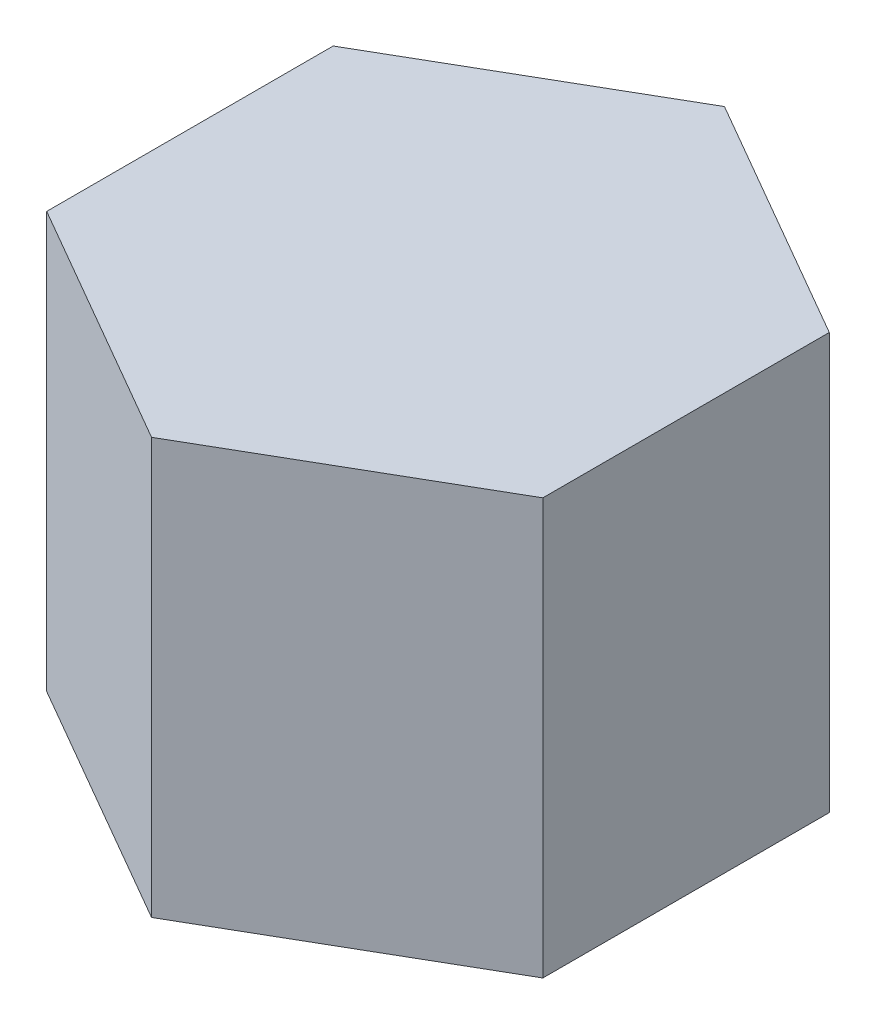
ISO-10303-21;
HEADER;
FILE_DESCRIPTION(('STEP AP214'),'2;1');
FILE_NAME('part.step','',(''),(''),'','','');
FILE_SCHEMA(('AUTOMOTIVE_DESIGN { 1 0 10303 214 1 1 1 1 }'));
ENDSEC;
DATA;
#1=APPLICATION_CONTEXT('core data for automotive mechanical design processes');
#2=APPLICATION_PROTOCOL_DEFINITION('international standard','automotive_design',2000,#1);
#3=PRODUCT_CONTEXT('',#1,'mechanical');
#4=PRODUCT('Part','Part','',(#3));
#5=PRODUCT_RELATED_PRODUCT_CATEGORY('part','',(#4));
#6=PRODUCT_DEFINITION_FORMATION('','',#4);
#7=PRODUCT_DEFINITION_CONTEXT('part definition',#1,'design');
#8=PRODUCT_DEFINITION('design','',#6,#7);
#9=PRODUCT_DEFINITION_SHAPE('','',#8);
#10=(LENGTH_UNIT() NAMED_UNIT(*) SI_UNIT(.MILLI.,.METRE.));
#11=(NAMED_UNIT(*) PLANE_ANGLE_UNIT() SI_UNIT($,.RADIAN.));
#12=(NAMED_UNIT(*) SI_UNIT($,.STERADIAN.) SOLID_ANGLE_UNIT());
#13=UNCERTAINTY_MEASURE_WITH_UNIT(LENGTH_MEASURE(1.E-05),#10,'distance_accuracy_value','');
#14=(GEOMETRIC_REPRESENTATION_CONTEXT(3) GLOBAL_UNCERTAINTY_ASSIGNED_CONTEXT((#13)) GLOBAL_UNIT_ASSIGNED_CONTEXT((#10,
#11,#12)) REPRESENTATION_CONTEXT('',''));
#15=CARTESIAN_POINT('',(0.,0.,0.));
#16=DIRECTION('',(0.,0.,1.));
#17=DIRECTION('',(1.,0.,0.));
#18=AXIS2_PLACEMENT_3D('',#15,#16,#17);
#19=CARTESIAN_POINT('',(207.142660308706,-148.537700895744,294.105047431848));
#20=DIRECTION('',(-0.499999999999909,0.,-0.866025403784491));
#21=DIRECTION('',(-0.866025403784491,0.,0.499999999999909));
#22=AXIS2_PLACEMENT_3D('',#19,#20,#21);
#23=PLANE('',#22);
#24=CARTESIAN_POINT('',(206.839551417381,-149.045793579175,294.280047431848));
#25=DIRECTION('',(0.866025403784491,0.,-0.499999999999909));
#26=VECTOR('',#25,1.);
#27=LINE('',#24,#26);
#28=CARTESIAN_POINT('',(206.839551417382,-149.045793579175,294.280047431848));
#29=VERTEX_POINT('',#28);
#30=CARTESIAN_POINT('',(207.142660308706,-149.045793579175,294.105047431848));
#31=VERTEX_POINT('',#30);
#32=EDGE_CURVE('E170',#29,#31,#27,.T.);
#33=ORIENTED_EDGE('',*,*,#32,.T.);
#34=CARTESIAN_POINT('',(207.142660308706,-148.537700895744,294.105047431848));
#35=DIRECTION('',(0.,-1.,0.));
#36=VECTOR('',#35,1.);
#37=LINE('',#34,#36);
#38=CARTESIAN_POINT('',(207.142660308706,-148.537700895744,294.105047431848));
#39=VERTEX_POINT('',#38);
#40=EDGE_CURVE('E35',#39,#31,#37,.T.);
#41=ORIENTED_EDGE('',*,*,#40,.F.);
#42=CARTESIAN_POINT('',(206.839551417381,-148.537700895744,294.280047431848));
#43=DIRECTION('',(0.866025403784491,0.,-0.499999999999909));
#44=VECTOR('',#43,1.);
#45=LINE('',#42,#44);
#46=CARTESIAN_POINT('',(206.839551417382,-148.537700895744,294.280047431848));
#47=VERTEX_POINT('',#46);
#48=EDGE_CURVE('E159',#47,#39,#45,.T.);
#49=ORIENTED_EDGE('',*,*,#48,.F.);
#50=CARTESIAN_POINT('',(206.839551417381,-148.537700895744,294.280047431848));
#51=DIRECTION('',(0.,-1.,0.));
#52=VECTOR('',#51,1.);
#53=LINE('',#50,#52);
#54=EDGE_CURVE('E10',#47,#29,#53,.T.);
#55=ORIENTED_EDGE('',*,*,#54,.T.);
#56=EDGE_LOOP('',(#33,#41,#49,#55));
#57=FACE_BOUND('',#56,.T.);
#58=ADVANCED_FACE('F16',(#57),#23,.F.);
#59=CARTESIAN_POINT('',(206.839551417382,-148.537700895744,294.280047431848));
#60=DIRECTION('',(0.500000000000062,0.,-0.866025403784403));
#61=DIRECTION('',(-0.866025403784403,0.,-0.500000000000062));
#62=AXIS2_PLACEMENT_3D('',#59,#60,#61);
#63=PLANE('',#62);
#64=CARTESIAN_POINT('',(206.536442526057,-149.045793579175,294.105047431848));
#65=DIRECTION('',(0.866025403784403,0.,0.500000000000062));
#66=VECTOR('',#65,1.);
#67=LINE('',#64,#66);
#68=CARTESIAN_POINT('',(206.536442526057,-149.045793579175,294.105047431848));
#69=VERTEX_POINT('',#68);
#70=EDGE_CURVE('E167',#69,#29,#67,.T.);
#71=ORIENTED_EDGE('',*,*,#70,.T.);
#72=ORIENTED_EDGE('',*,*,#54,.F.);
#73=CARTESIAN_POINT('',(206.536442526057,-148.537700895744,294.105047431848));
#74=DIRECTION('',(0.866025403784403,0.,0.500000000000062));
#75=VECTOR('',#74,1.);
#76=LINE('',#73,#75);
#77=CARTESIAN_POINT('',(206.536442526057,-148.537700895744,294.105047431848));
#78=VERTEX_POINT('',#77);
#79=EDGE_CURVE('E156',#78,#47,#76,.T.);
#80=ORIENTED_EDGE('',*,*,#79,.F.);
#81=CARTESIAN_POINT('',(206.536442526057,-148.537700895744,294.105047431848));
#82=DIRECTION('',(0.,-1.,0.));
#83=VECTOR('',#82,1.);
#84=LINE('',#81,#83);
#85=EDGE_CURVE('E27',#78,#69,#84,.T.);
#86=ORIENTED_EDGE('',*,*,#85,.T.);
#87=EDGE_LOOP('',(#71,#72,#80,#86));
#88=FACE_BOUND('',#87,.T.);
#89=ADVANCED_FACE('F189',(#88),#63,.F.);
#90=CARTESIAN_POINT('',(206.536442526057,-148.537700895744,290.831971220494));
#91=DIRECTION('',(1.,0.,0.));
#92=DIRECTION('',(0.,1.,0.));
#93=AXIS2_PLACEMENT_3D('',#90,#91,#92);
#94=PLANE('',#93);
#95=CARTESIAN_POINT('',(206.536442526057,-149.045793579175,293.755047431848));
#96=DIRECTION('',(0.,0.,1.));
#97=VECTOR('',#96,1.);
#98=LINE('',#95,#97);
#99=CARTESIAN_POINT('',(206.536442526057,-149.045793579175,293.755047431848));
#100=VERTEX_POINT('',#99);
#101=EDGE_CURVE('E163',#100,#69,#98,.T.);
#102=ORIENTED_EDGE('',*,*,#101,.T.);
#103=ORIENTED_EDGE('',*,*,#85,.F.);
#104=CARTESIAN_POINT('',(206.536442526057,-148.537700895744,293.755047431848));
#105=DIRECTION('',(0.,0.,1.));
#106=VECTOR('',#105,1.);
#107=LINE('',#104,#106);
#108=CARTESIAN_POINT('',(206.536442526057,-148.537700895744,293.755047431848));
#109=VERTEX_POINT('',#108);
#110=EDGE_CURVE('E106',#109,#78,#107,.T.);
#111=ORIENTED_EDGE('',*,*,#110,.F.);
#112=CARTESIAN_POINT('',(206.536442526057,-148.537700895744,293.755047431848));
#113=DIRECTION('',(0.,-1.,0.));
#114=VECTOR('',#113,1.);
#115=LINE('',#112,#114);
#116=EDGE_CURVE('E94',#109,#100,#115,.T.);
#117=ORIENTED_EDGE('',*,*,#116,.T.);
#118=EDGE_LOOP('',(#102,#103,#111,#117));
#119=FACE_BOUND('',#118,.T.);
#120=ADVANCED_FACE('F198',(#119),#94,.F.);
#121=CARTESIAN_POINT('',(206.536442526057,-148.537700895744,293.755047431848));
#122=DIRECTION('',(0.499999999999978,0.,0.866025403784452));
#123=DIRECTION('',(0.866025403784452,0.,-0.499999999999978));
#124=AXIS2_PLACEMENT_3D('',#121,#122,#123);
#125=PLANE('',#124);
#126=CARTESIAN_POINT('',(206.839551417382,-149.045793579175,293.580047431848));
#127=DIRECTION('',(-0.866025403784452,0.,0.499999999999978));
#128=VECTOR('',#127,1.);
#129=LINE('',#126,#128);
#130=CARTESIAN_POINT('',(206.839551417382,-149.045793579175,293.580047431848));
#131=VERTEX_POINT('',#130);
#132=EDGE_CURVE('E162',#131,#100,#129,.T.);
#133=ORIENTED_EDGE('',*,*,#132,.T.);
#134=ORIENTED_EDGE('',*,*,#116,.F.);
#135=CARTESIAN_POINT('',(206.839551417382,-148.537700895744,293.580047431848));
#136=DIRECTION('',(-0.866025403784452,0.,0.499999999999978));
#137=VECTOR('',#136,1.);
#138=LINE('',#135,#137);
#139=CARTESIAN_POINT('',(206.839551417382,-148.537700895744,293.580047431848));
#140=VERTEX_POINT('',#139);
#141=EDGE_CURVE('E98',#140,#109,#138,.T.);
#142=ORIENTED_EDGE('',*,*,#141,.F.);
#143=CARTESIAN_POINT('',(206.839551417382,-148.537700895744,293.580047431848));
#144=DIRECTION('',(0.,-1.,0.));
#145=VECTOR('',#144,1.);
#146=LINE('',#143,#145);
#147=EDGE_CURVE('E79',#140,#131,#146,.T.);
#148=ORIENTED_EDGE('',*,*,#147,.T.);
#149=EDGE_LOOP('',(#133,#134,#142,#148));
#150=FACE_BOUND('',#149,.T.);
#151=ADVANCED_FACE('F100',(#150),#125,.F.);
#152=CARTESIAN_POINT('',(206.839551417382,-148.537700895744,293.580047431848));
#153=DIRECTION('',(-0.500000000000012,0.,0.866025403784432));
#154=DIRECTION('',(0.866025403784432,0.,0.500000000000012));
#155=AXIS2_PLACEMENT_3D('',#152,#153,#154);
#156=PLANE('',#155);
#157=CARTESIAN_POINT('',(207.142660308706,-149.045793579175,293.755047431848));
#158=DIRECTION('',(-0.866025403784432,0.,-0.500000000000012));
#159=VECTOR('',#158,1.);
#160=LINE('',#157,#159);
#161=CARTESIAN_POINT('',(207.142660308706,-149.045793579175,293.755047431848));
#162=VERTEX_POINT('',#161);
#163=EDGE_CURVE('E88',#162,#131,#160,.T.);
#164=ORIENTED_EDGE('',*,*,#163,.T.);
#165=ORIENTED_EDGE('',*,*,#147,.F.);
#166=CARTESIAN_POINT('',(207.142660308706,-148.537700895744,293.755047431848));
#167=DIRECTION('',(-0.866025403784432,0.,-0.500000000000012));
#168=VECTOR('',#167,1.);
#169=LINE('',#166,#168);
#170=CARTESIAN_POINT('',(207.142660308706,-148.537700895744,293.755047431848));
#171=VERTEX_POINT('',#170);
#172=EDGE_CURVE('E84',#171,#140,#169,.T.);
#173=ORIENTED_EDGE('',*,*,#172,.F.);
#174=CARTESIAN_POINT('',(207.142660308706,-148.537700895744,293.755047431848));
#175=DIRECTION('',(0.,-1.,0.));
#176=VECTOR('',#175,1.);
#177=LINE('',#174,#176);
#178=EDGE_CURVE('E58',#171,#162,#177,.T.);
#179=ORIENTED_EDGE('',*,*,#178,.T.);
#180=EDGE_LOOP('',(#164,#165,#173,#179));
#181=FACE_BOUND('',#180,.T.);
#182=ADVANCED_FACE('F82',(#181),#156,.F.);
#183=CARTESIAN_POINT('',(207.142660308706,-148.537700895744,290.831971220494));
#184=DIRECTION('',(-1.,0.,0.));
#185=DIRECTION('',(0.,-1.,0.));
#186=AXIS2_PLACEMENT_3D('',#183,#184,#185);
#187=PLANE('',#186);
#188=CARTESIAN_POINT('',(207.142660308706,-149.045793579175,294.105047431848));
#189=DIRECTION('',(0.,0.,-1.));
#190=VECTOR('',#189,1.);
#191=LINE('',#188,#190);
#192=EDGE_CURVE('E160',#31,#162,#191,.T.);
#193=ORIENTED_EDGE('',*,*,#192,.T.);
#194=ORIENTED_EDGE('',*,*,#178,.F.);
#195=CARTESIAN_POINT('',(207.142660308706,-148.537700895744,294.105047431848));
#196=DIRECTION('',(0.,0.,-1.));
#197=VECTOR('',#196,1.);
#198=LINE('',#195,#197);
#199=EDGE_CURVE('E112',#39,#171,#198,.T.);
#200=ORIENTED_EDGE('',*,*,#199,.F.);
#201=ORIENTED_EDGE('',*,*,#40,.T.);
#202=EDGE_LOOP('',(#193,#194,#200,#201));
#203=FACE_BOUND('',#202,.T.);
#204=ADVANCED_FACE('F131',(#203),#187,.F.);
#205=CARTESIAN_POINT('',(206.339551417382,-148.537700895744,290.831971220494));
#206=DIRECTION('',(0.,-1.,0.));
#207=DIRECTION('',(1.,0.,0.));
#208=AXIS2_PLACEMENT_3D('',#205,#206,#207);
#209=PLANE('',#208);
#210=ORIENTED_EDGE('',*,*,#48,.T.);
#211=ORIENTED_EDGE('',*,*,#199,.T.);
#212=ORIENTED_EDGE('',*,*,#172,.T.);
#213=ORIENTED_EDGE('',*,*,#141,.T.);
#214=ORIENTED_EDGE('',*,*,#110,.T.);
#215=ORIENTED_EDGE('',*,*,#79,.T.);
#216=EDGE_LOOP('',(#210,#211,#212,#213,#214,#215));
#217=FACE_BOUND('',#216,.T.);
#218=ADVANCED_FACE('F111',(#217),#209,.F.);
#219=CARTESIAN_POINT('',(206.339551417382,-149.045793579175,290.831971220494));
#220=DIRECTION('',(0.,-1.,0.));
#221=DIRECTION('',(1.,0.,0.));
#222=AXIS2_PLACEMENT_3D('',#219,#220,#221);
#223=PLANE('',#222);
#224=ORIENTED_EDGE('',*,*,#32,.F.);
#225=ORIENTED_EDGE('',*,*,#70,.F.);
#226=ORIENTED_EDGE('',*,*,#101,.F.);
#227=ORIENTED_EDGE('',*,*,#132,.F.);
#228=ORIENTED_EDGE('',*,*,#163,.F.);
#229=ORIENTED_EDGE('',*,*,#192,.F.);
#230=EDGE_LOOP('',(#224,#225,#226,#227,#228,#229));
#231=FACE_BOUND('',#230,.T.);
#232=ADVANCED_FACE('F130',(#231),#223,.T.);
#233=CLOSED_SHELL('',(#58,#89,#120,#151,#182,#204,#218,#232));
#234=MANIFOLD_SOLID_BREP('B1',#233);
#235=ADVANCED_BREP_SHAPE_REPRESENTATION('',(#18,#234),#14);
#236=SHAPE_DEFINITION_REPRESENTATION(#9,#235);
ENDSEC;
END-ISO-10303-21;
